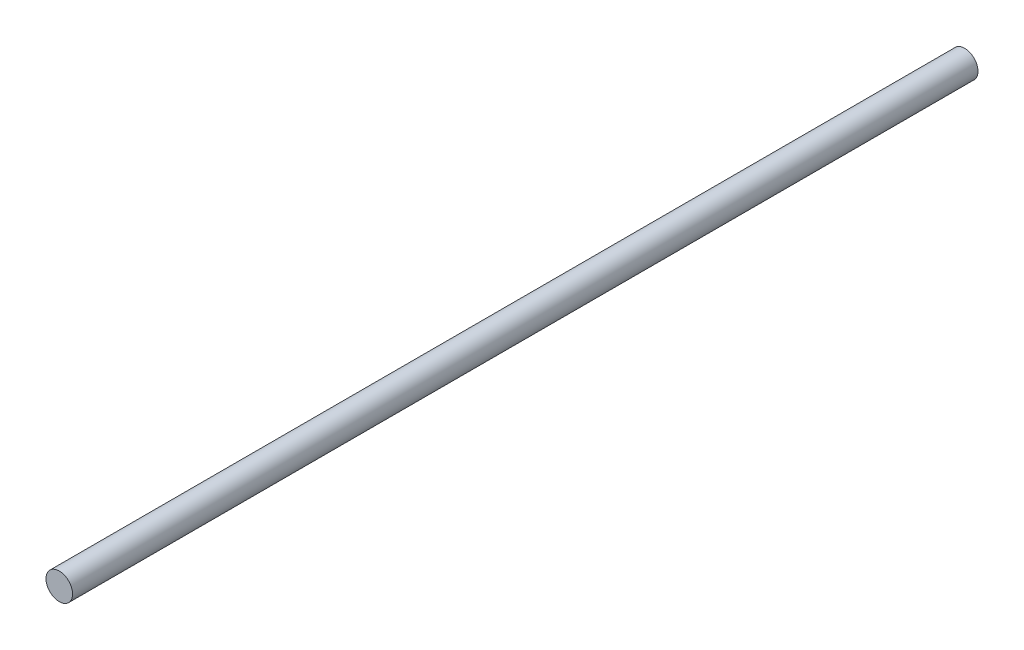
ISO-10303-21;
HEADER;
FILE_DESCRIPTION(('STEP AP214'),'2;1');
FILE_NAME('part.step','',(''),(''),'','','');
FILE_SCHEMA(('AUTOMOTIVE_DESIGN { 1 0 10303 214 1 1 1 1 }'));
ENDSEC;
DATA;
#1=APPLICATION_CONTEXT('core data for automotive mechanical design processes');
#2=APPLICATION_PROTOCOL_DEFINITION('international standard','automotive_design',2000,#1);
#3=PRODUCT_CONTEXT('',#1,'mechanical');
#4=PRODUCT('Part','Part','',(#3));
#5=PRODUCT_RELATED_PRODUCT_CATEGORY('part','',(#4));
#6=PRODUCT_DEFINITION_FORMATION('','',#4);
#7=PRODUCT_DEFINITION_CONTEXT('part definition',#1,'design');
#8=PRODUCT_DEFINITION('design','',#6,#7);
#9=PRODUCT_DEFINITION_SHAPE('','',#8);
#10=(LENGTH_UNIT() NAMED_UNIT(*) SI_UNIT(.MILLI.,.METRE.));
#11=(NAMED_UNIT(*) PLANE_ANGLE_UNIT() SI_UNIT($,.RADIAN.));
#12=(NAMED_UNIT(*) SI_UNIT($,.STERADIAN.) SOLID_ANGLE_UNIT());
#13=UNCERTAINTY_MEASURE_WITH_UNIT(LENGTH_MEASURE(1.E-05),#10,'distance_accuracy_value','');
#14=(GEOMETRIC_REPRESENTATION_CONTEXT(3) GLOBAL_UNCERTAINTY_ASSIGNED_CONTEXT((#13)) GLOBAL_UNIT_ASSIGNED_CONTEXT((#10,
#11,#12)) REPRESENTATION_CONTEXT('',''));
#15=CARTESIAN_POINT('',(0.,0.,0.));
#16=DIRECTION('',(0.,0.,1.));
#17=DIRECTION('',(1.,0.,0.));
#18=AXIS2_PLACEMENT_3D('',#15,#16,#17);
#19=CARTESIAN_POINT('',(0.,0.,432.562));
#20=DIRECTION('',(0.,0.,-1.));
#21=DIRECTION('',(-1.,0.,0.));
#22=AXIS2_PLACEMENT_3D('',#19,#20,#21);
#23=CYLINDRICAL_SURFACE('',#22,6.35);
#24=CARTESIAN_POINT('',(0.,0.,432.562));
#25=DIRECTION('',(0.,0.,1.));
#26=DIRECTION('',(1.,0.,0.));
#27=AXIS2_PLACEMENT_3D('',#24,#25,#26);
#28=CIRCLE('',#27,6.35);
#29=CARTESIAN_POINT('',(6.35,0.,432.562));
#30=VERTEX_POINT('',#29);
#31=EDGE_CURVE('E10',#30,#30,#28,.T.);
#32=ORIENTED_EDGE('',*,*,#31,.F.);
#33=EDGE_LOOP('',(#32));
#34=FACE_BOUND('',#33,.T.);
#35=CARTESIAN_POINT('',(0.,0.,0.));
#36=DIRECTION('',(0.,0.,1.));
#37=DIRECTION('',(1.,0.,0.));
#38=AXIS2_PLACEMENT_3D('',#35,#36,#37);
#39=CIRCLE('',#38,6.35);
#40=CARTESIAN_POINT('',(6.35,0.,0.));
#41=VERTEX_POINT('',#40);
#42=EDGE_CURVE('E40',#41,#41,#39,.T.);
#43=ORIENTED_EDGE('',*,*,#42,.T.);
#44=EDGE_LOOP('',(#43));
#45=FACE_BOUND('',#44,.T.);
#46=ADVANCED_FACE('F37',(#34,#45),#23,.T.);
#47=CARTESIAN_POINT('',(0.,0.,432.562));
#48=DIRECTION('',(0.,0.,1.));
#49=DIRECTION('',(1.,0.,0.));
#50=AXIS2_PLACEMENT_3D('',#47,#48,#49);
#51=PLANE('',#50);
#52=ORIENTED_EDGE('',*,*,#31,.T.);
#53=EDGE_LOOP('',(#52));
#54=FACE_BOUND('',#53,.T.);
#55=ADVANCED_FACE('F52',(#54),#51,.T.);
#56=CARTESIAN_POINT('',(0.,0.,0.));
#57=DIRECTION('',(0.,0.,1.));
#58=DIRECTION('',(1.,0.,0.));
#59=AXIS2_PLACEMENT_3D('',#56,#57,#58);
#60=PLANE('',#59);
#61=ORIENTED_EDGE('',*,*,#42,.F.);
#62=EDGE_LOOP('',(#61));
#63=FACE_BOUND('',#62,.T.);
#64=ADVANCED_FACE('F50',(#63),#60,.F.);
#65=CLOSED_SHELL('',(#46,#55,#64));
#66=MANIFOLD_SOLID_BREP('B2',#65);
#67=ADVANCED_BREP_SHAPE_REPRESENTATION('',(#18,#66),#14);
#68=SHAPE_DEFINITION_REPRESENTATION(#9,#67);
ENDSEC;
END-ISO-10303-21;
